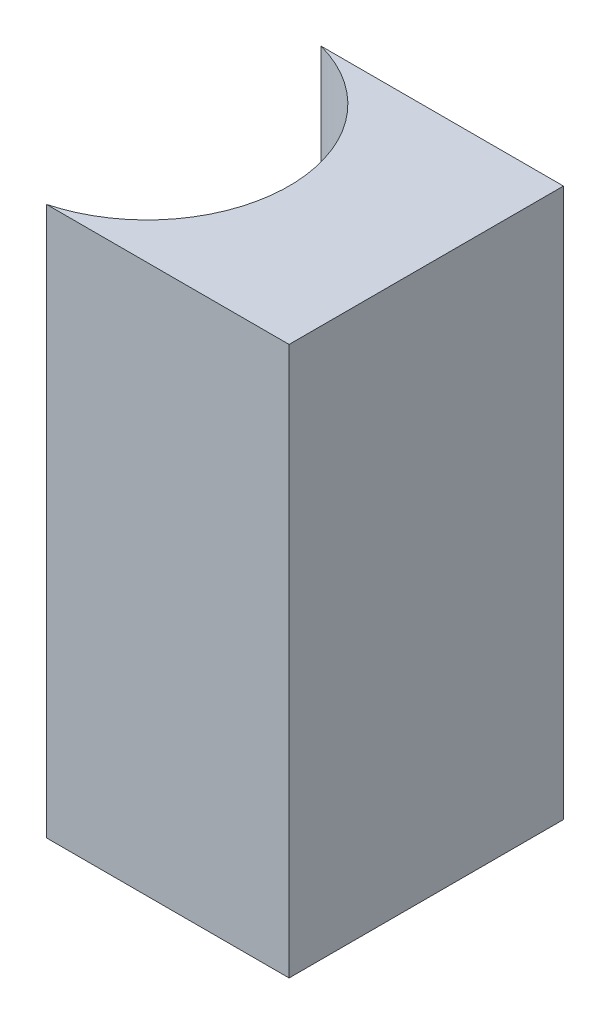
ISO-10303-21;
HEADER;
FILE_DESCRIPTION(('STEP AP214'),'2;1');
FILE_NAME('part.step','',(''),(''),'','','');
FILE_SCHEMA(('AUTOMOTIVE_DESIGN { 1 0 10303 214 1 1 1 1 }'));
ENDSEC;
DATA;
#1=APPLICATION_CONTEXT('core data for automotive mechanical design processes');
#2=APPLICATION_PROTOCOL_DEFINITION('international standard','automotive_design',2000,#1);
#3=PRODUCT_CONTEXT('',#1,'mechanical');
#4=PRODUCT('Part','Part','',(#3));
#5=PRODUCT_RELATED_PRODUCT_CATEGORY('part','',(#4));
#6=PRODUCT_DEFINITION_FORMATION('','',#4);
#7=PRODUCT_DEFINITION_CONTEXT('part definition',#1,'design');
#8=PRODUCT_DEFINITION('design','',#6,#7);
#9=PRODUCT_DEFINITION_SHAPE('','',#8);
#10=(LENGTH_UNIT() NAMED_UNIT(*) SI_UNIT(.MILLI.,.METRE.));
#11=(NAMED_UNIT(*) PLANE_ANGLE_UNIT() SI_UNIT($,.RADIAN.));
#12=(NAMED_UNIT(*) SI_UNIT($,.STERADIAN.) SOLID_ANGLE_UNIT());
#13=UNCERTAINTY_MEASURE_WITH_UNIT(LENGTH_MEASURE(1.E-05),#10,'distance_accuracy_value','');
#14=(GEOMETRIC_REPRESENTATION_CONTEXT(3) GLOBAL_UNCERTAINTY_ASSIGNED_CONTEXT((#13)) GLOBAL_UNIT_ASSIGNED_CONTEXT((#10,
#11,#12)) REPRESENTATION_CONTEXT('',''));
#15=CARTESIAN_POINT('',(0.,0.,0.));
#16=DIRECTION('',(0.,0.,1.));
#17=DIRECTION('',(1.,0.,0.));
#18=AXIS2_PLACEMENT_3D('',#15,#16,#17);
#19=CARTESIAN_POINT('',(0.,8.,0.));
#20=DIRECTION('',(0.,0.,1.));
#21=DIRECTION('',(1.,0.,0.));
#22=AXIS2_PLACEMENT_3D('',#19,#20,#21);
#23=PLANE('',#22);
#24=DIRECTION('',(-1.,0.,0.));
#25=VECTOR('',#24,1.);
#26=CARTESIAN_POINT('',(0.,0.,0.));
#27=LINE('',#26,#25);
#28=CARTESIAN_POINT('',(0.,0.,0.));
#29=VERTEX_POINT('',#28);
#30=CARTESIAN_POINT('',(-3.5362397541967,0.,0.));
#31=VERTEX_POINT('',#30);
#32=EDGE_CURVE('E109',#29,#31,#27,.T.);
#33=ORIENTED_EDGE('',*,*,#32,.T.);
#34=DIRECTION('',(0.,-1.,0.));
#35=VECTOR('',#34,1.);
#36=CARTESIAN_POINT('',(-3.5362397541967,8.,0.));
#37=LINE('',#36,#35);
#38=CARTESIAN_POINT('',(-3.5362397541967,8.,0.));
#39=VERTEX_POINT('',#38);
#40=EDGE_CURVE('E11',#39,#31,#37,.T.);
#41=ORIENTED_EDGE('',*,*,#40,.F.);
#42=DIRECTION('',(-1.,0.,0.));
#43=VECTOR('',#42,1.);
#44=CARTESIAN_POINT('',(0.,8.,0.));
#45=LINE('',#44,#43);
#46=CARTESIAN_POINT('',(0.,8.,0.));
#47=VERTEX_POINT('',#46);
#48=EDGE_CURVE('E93',#47,#39,#45,.T.);
#49=ORIENTED_EDGE('',*,*,#48,.F.);
#50=DIRECTION('',(0.,-1.,0.));
#51=VECTOR('',#50,1.);
#52=CARTESIAN_POINT('',(0.,8.,0.));
#53=LINE('',#52,#51);
#54=EDGE_CURVE('E105',#47,#29,#53,.T.);
#55=ORIENTED_EDGE('',*,*,#54,.T.);
#56=EDGE_LOOP('',(#33,#41,#49,#55));
#57=FACE_BOUND('',#56,.T.);
#58=ADVANCED_FACE('F41',(#57),#23,.F.);
#59=CARTESIAN_POINT('',(-4.07,8.,2.));
#60=DIRECTION('',(0.,-1.,0.));
#61=DIRECTION('',(0.,0.,-1.));
#62=AXIS2_PLACEMENT_3D('',#59,#60,#61);
#63=CYLINDRICAL_SURFACE('',#62,2.07);
#64=CARTESIAN_POINT('',(-4.07,0.,2.));
#65=DIRECTION('',(0.,-1.,0.));
#66=DIRECTION('',(0.,0.,1.));
#67=AXIS2_PLACEMENT_3D('',#64,#65,#66);
#68=CIRCLE('',#67,2.07);
#69=CARTESIAN_POINT('',(-3.5362397541967,0.,4.));
#70=VERTEX_POINT('',#69);
#71=EDGE_CURVE('E98',#31,#70,#68,.T.);
#72=ORIENTED_EDGE('',*,*,#71,.T.);
#73=DIRECTION('',(0.,-1.,0.));
#74=VECTOR('',#73,1.);
#75=CARTESIAN_POINT('',(-3.5362397541967,8.,4.));
#76=LINE('',#75,#74);
#77=CARTESIAN_POINT('',(-3.5362397541967,8.,4.));
#78=VERTEX_POINT('',#77);
#79=EDGE_CURVE('E50',#78,#70,#76,.T.);
#80=ORIENTED_EDGE('',*,*,#79,.F.);
#81=CARTESIAN_POINT('',(-4.07,8.,2.));
#82=DIRECTION('',(0.,-1.,0.));
#83=DIRECTION('',(0.,0.,1.));
#84=AXIS2_PLACEMENT_3D('',#81,#82,#83);
#85=CIRCLE('',#84,2.07);
#86=EDGE_CURVE('E88',#39,#78,#85,.T.);
#87=ORIENTED_EDGE('',*,*,#86,.F.);
#88=ORIENTED_EDGE('',*,*,#40,.T.);
#89=EDGE_LOOP('',(#72,#80,#87,#88));
#90=FACE_BOUND('',#89,.T.);
#91=ADVANCED_FACE('F97',(#90),#63,.F.);
#92=CARTESIAN_POINT('',(0.,8.,4.));
#93=DIRECTION('',(0.,0.,-1.));
#94=DIRECTION('',(-1.,0.,0.));
#95=AXIS2_PLACEMENT_3D('',#92,#93,#94);
#96=PLANE('',#95);
#97=DIRECTION('',(1.,0.,0.));
#98=VECTOR('',#97,1.);
#99=CARTESIAN_POINT('',(0.,0.,4.));
#100=LINE('',#99,#98);
#101=CARTESIAN_POINT('',(0.,0.,4.));
#102=VERTEX_POINT('',#101);
#103=EDGE_CURVE('E75',#70,#102,#100,.T.);
#104=ORIENTED_EDGE('',*,*,#103,.T.);
#105=DIRECTION('',(0.,-1.,0.));
#106=VECTOR('',#105,1.);
#107=CARTESIAN_POINT('',(0.,8.,4.));
#108=LINE('',#107,#106);
#109=CARTESIAN_POINT('',(0.,8.,4.));
#110=VERTEX_POINT('',#109);
#111=EDGE_CURVE('E100',#110,#102,#108,.T.);
#112=ORIENTED_EDGE('',*,*,#111,.F.);
#113=DIRECTION('',(1.,0.,0.));
#114=VECTOR('',#113,1.);
#115=CARTESIAN_POINT('',(0.,8.,4.));
#116=LINE('',#115,#114);
#117=EDGE_CURVE('E91',#78,#110,#116,.T.);
#118=ORIENTED_EDGE('',*,*,#117,.F.);
#119=ORIENTED_EDGE('',*,*,#79,.T.);
#120=EDGE_LOOP('',(#104,#112,#118,#119));
#121=FACE_BOUND('',#120,.T.);
#122=ADVANCED_FACE('F101',(#121),#96,.F.);
#123=CARTESIAN_POINT('',(0.,8.,0.));
#124=DIRECTION('',(-1.,0.,0.));
#125=DIRECTION('',(0.,0.,1.));
#126=AXIS2_PLACEMENT_3D('',#123,#124,#125);
#127=PLANE('',#126);
#128=DIRECTION('',(0.,0.,-1.));
#129=VECTOR('',#128,1.);
#130=CARTESIAN_POINT('',(0.,0.,0.));
#131=LINE('',#130,#129);
#132=EDGE_CURVE('E81',#102,#29,#131,.T.);
#133=ORIENTED_EDGE('',*,*,#132,.T.);
#134=ORIENTED_EDGE('',*,*,#54,.F.);
#135=DIRECTION('',(0.,0.,-1.));
#136=VECTOR('',#135,1.);
#137=CARTESIAN_POINT('',(0.,8.,0.));
#138=LINE('',#137,#136);
#139=EDGE_CURVE('E58',#110,#47,#138,.T.);
#140=ORIENTED_EDGE('',*,*,#139,.F.);
#141=ORIENTED_EDGE('',*,*,#111,.T.);
#142=EDGE_LOOP('',(#133,#134,#140,#141));
#143=FACE_BOUND('',#142,.T.);
#144=ADVANCED_FACE('F122',(#143),#127,.F.);
#145=CARTESIAN_POINT('',(-4.07,8.,2.));
#146=DIRECTION('',(0.,1.,0.));
#147=DIRECTION('',(0.,0.,1.));
#148=AXIS2_PLACEMENT_3D('',#145,#146,#147);
#149=PLANE('',#148);
#150=ORIENTED_EDGE('',*,*,#48,.T.);
#151=ORIENTED_EDGE('',*,*,#86,.T.);
#152=ORIENTED_EDGE('',*,*,#117,.T.);
#153=ORIENTED_EDGE('',*,*,#139,.T.);
#154=EDGE_LOOP('',(#150,#151,#152,#153));
#155=FACE_BOUND('',#154,.T.);
#156=ADVANCED_FACE('F89',(#155),#149,.T.);
#157=CARTESIAN_POINT('',(-4.07,0.,2.));
#158=DIRECTION('',(0.,1.,0.));
#159=DIRECTION('',(0.,0.,1.));
#160=AXIS2_PLACEMENT_3D('',#157,#158,#159);
#161=PLANE('',#160);
#162=ORIENTED_EDGE('',*,*,#32,.F.);
#163=ORIENTED_EDGE('',*,*,#132,.F.);
#164=ORIENTED_EDGE('',*,*,#103,.F.);
#165=ORIENTED_EDGE('',*,*,#71,.F.);
#166=EDGE_LOOP('',(#162,#163,#164,#165));
#167=FACE_BOUND('',#166,.T.);
#168=ADVANCED_FACE('F125',(#167),#161,.F.);
#169=CLOSED_SHELL('',(#58,#91,#122,#144,#156,#168));
#170=MANIFOLD_SOLID_BREP('B2',#169);
#171=ADVANCED_BREP_SHAPE_REPRESENTATION('',(#18,#170),#14);
#172=SHAPE_DEFINITION_REPRESENTATION(#9,#171);
ENDSEC;
END-ISO-10303-21;
